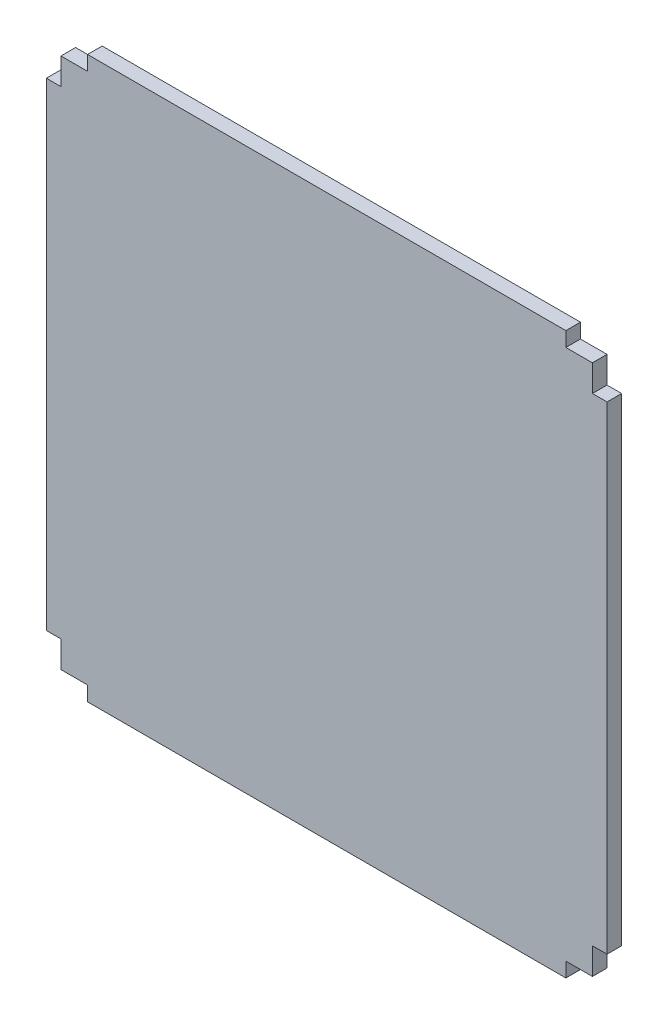
ISO-10303-21;
HEADER;
FILE_DESCRIPTION(('STEP AP214'),'2;1');
FILE_NAME('part.step','',(''),(''),'','','');
FILE_SCHEMA(('AUTOMOTIVE_DESIGN { 1 0 10303 214 1 1 1 1 }'));
ENDSEC;
DATA;
#1=APPLICATION_CONTEXT('core data for automotive mechanical design processes');
#2=APPLICATION_PROTOCOL_DEFINITION('international standard','automotive_design',2000,#1);
#3=PRODUCT_CONTEXT('',#1,'mechanical');
#4=PRODUCT('Part','Part','',(#3));
#5=PRODUCT_RELATED_PRODUCT_CATEGORY('part','',(#4));
#6=PRODUCT_DEFINITION_FORMATION('','',#4);
#7=PRODUCT_DEFINITION_CONTEXT('part definition',#1,'design');
#8=PRODUCT_DEFINITION('design','',#6,#7);
#9=PRODUCT_DEFINITION_SHAPE('','',#8);
#10=(LENGTH_UNIT() NAMED_UNIT(*) SI_UNIT(.MILLI.,.METRE.));
#11=(NAMED_UNIT(*) PLANE_ANGLE_UNIT() SI_UNIT($,.RADIAN.));
#12=(NAMED_UNIT(*) SI_UNIT($,.STERADIAN.) SOLID_ANGLE_UNIT());
#13=UNCERTAINTY_MEASURE_WITH_UNIT(LENGTH_MEASURE(1.E-05),#10,'distance_accuracy_value','');
#14=(GEOMETRIC_REPRESENTATION_CONTEXT(3) GLOBAL_UNCERTAINTY_ASSIGNED_CONTEXT((#13)) GLOBAL_UNIT_ASSIGNED_CONTEXT((#10,
#11,#12)) REPRESENTATION_CONTEXT('',''));
#15=CARTESIAN_POINT('',(0.,0.,0.));
#16=DIRECTION('',(0.,0.,1.));
#17=DIRECTION('',(1.,0.,0.));
#18=AXIS2_PLACEMENT_3D('',#15,#16,#17);
#19=CARTESIAN_POINT('',(0.,0.,2.75));
#20=DIRECTION('',(0.,1.,0.));
#21=DIRECTION('',(0.,0.,1.));
#22=AXIS2_PLACEMENT_3D('',#19,#20,#21);
#23=PLANE('',#22);
#24=DIRECTION('',(1.,0.,0.));
#25=VECTOR('',#24,1.);
#26=CARTESIAN_POINT('',(0.,0.,0.));
#27=LINE('',#26,#25);
#28=CARTESIAN_POINT('',(0.,0.,0.));
#29=VERTEX_POINT('',#28);
#30=CARTESIAN_POINT('',(5.,0.,0.));
#31=VERTEX_POINT('',#30);
#32=EDGE_CURVE('E205',#29,#31,#27,.T.);
#33=ORIENTED_EDGE('',*,*,#32,.T.);
#34=DIRECTION('',(0.,0.,-1.));
#35=VECTOR('',#34,1.);
#36=CARTESIAN_POINT('',(5.,0.,2.75));
#37=LINE('',#36,#35);
#38=CARTESIAN_POINT('',(5.,0.,2.75));
#39=VERTEX_POINT('',#38);
#40=EDGE_CURVE('E11',#39,#31,#37,.T.);
#41=ORIENTED_EDGE('',*,*,#40,.F.);
#42=DIRECTION('',(1.,0.,0.));
#43=VECTOR('',#42,1.);
#44=CARTESIAN_POINT('',(0.,0.,2.75));
#45=LINE('',#44,#43);
#46=CARTESIAN_POINT('',(0.,0.,2.75));
#47=VERTEX_POINT('',#46);
#48=EDGE_CURVE('E304',#47,#39,#45,.T.);
#49=ORIENTED_EDGE('',*,*,#48,.F.);
#50=DIRECTION('',(0.,0.,-1.));
#51=VECTOR('',#50,1.);
#52=CARTESIAN_POINT('',(0.,0.,2.75));
#53=LINE('',#52,#51);
#54=EDGE_CURVE('E200',#47,#29,#53,.T.);
#55=ORIENTED_EDGE('',*,*,#54,.T.);
#56=EDGE_LOOP('',(#33,#41,#49,#55));
#57=FACE_BOUND('',#56,.T.);
#58=ADVANCED_FACE('F35',(#57),#23,.F.);
#59=CARTESIAN_POINT('',(5.,0.,2.75));
#60=DIRECTION('',(1.,0.,0.));
#61=DIRECTION('',(0.,0.,-1.));
#62=AXIS2_PLACEMENT_3D('',#59,#60,#61);
#63=PLANE('',#62);
#64=DIRECTION('',(0.,-1.,0.));
#65=VECTOR('',#64,1.);
#66=CARTESIAN_POINT('',(5.,0.,0.));
#67=LINE('',#66,#65);
#68=CARTESIAN_POINT('',(5.,-2.75,0.));
#69=VERTEX_POINT('',#68);
#70=EDGE_CURVE('E208',#31,#69,#67,.T.);
#71=ORIENTED_EDGE('',*,*,#70,.T.);
#72=DIRECTION('',(0.,0.,-1.));
#73=VECTOR('',#72,1.);
#74=CARTESIAN_POINT('',(5.,-2.75,2.75));
#75=LINE('',#74,#73);
#76=CARTESIAN_POINT('',(5.,-2.75,2.75));
#77=VERTEX_POINT('',#76);
#78=EDGE_CURVE('E44',#77,#69,#75,.T.);
#79=ORIENTED_EDGE('',*,*,#78,.F.);
#80=DIRECTION('',(0.,-1.,0.));
#81=VECTOR('',#80,1.);
#82=CARTESIAN_POINT('',(5.,0.,2.75));
#83=LINE('',#82,#81);
#84=EDGE_CURVE('E131',#39,#77,#83,.T.);
#85=ORIENTED_EDGE('',*,*,#84,.F.);
#86=ORIENTED_EDGE('',*,*,#40,.T.);
#87=EDGE_LOOP('',(#71,#79,#85,#86));
#88=FACE_BOUND('',#87,.T.);
#89=ADVANCED_FACE('F37',(#88),#63,.F.);
#90=CARTESIAN_POINT('',(0.,-2.75,2.75));
#91=DIRECTION('',(0.,1.,0.));
#92=DIRECTION('',(0.,0.,1.));
#93=AXIS2_PLACEMENT_3D('',#90,#91,#92);
#94=PLANE('',#93);
#95=DIRECTION('',(1.,0.,0.));
#96=VECTOR('',#95,1.);
#97=CARTESIAN_POINT('',(0.,-2.75,0.));
#98=LINE('',#97,#96);
#99=CARTESIAN_POINT('',(95.,-2.75,0.));
#100=VERTEX_POINT('',#99);
#101=EDGE_CURVE('E211',#69,#100,#98,.T.);
#102=ORIENTED_EDGE('',*,*,#101,.T.);
#103=DIRECTION('',(0.,0.,-1.));
#104=VECTOR('',#103,1.);
#105=CARTESIAN_POINT('',(95.,-2.75,2.75));
#106=LINE('',#105,#104);
#107=CARTESIAN_POINT('',(95.,-2.75,2.75));
#108=VERTEX_POINT('',#107);
#109=EDGE_CURVE('E280',#108,#100,#106,.T.);
#110=ORIENTED_EDGE('',*,*,#109,.F.);
#111=DIRECTION('',(1.,0.,0.));
#112=VECTOR('',#111,1.);
#113=CARTESIAN_POINT('',(0.,-2.75,2.75));
#114=LINE('',#113,#112);
#115=EDGE_CURVE('E287',#77,#108,#114,.T.);
#116=ORIENTED_EDGE('',*,*,#115,.F.);
#117=ORIENTED_EDGE('',*,*,#78,.T.);
#118=EDGE_LOOP('',(#102,#110,#116,#117));
#119=FACE_BOUND('',#118,.T.);
#120=ADVANCED_FACE('F285',(#119),#94,.F.);
#121=CARTESIAN_POINT('',(95.,0.,2.75));
#122=DIRECTION('',(1.,0.,0.));
#123=DIRECTION('',(0.,0.,-1.));
#124=AXIS2_PLACEMENT_3D('',#121,#122,#123);
#125=PLANE('',#124);
#126=DIRECTION('',(0.,-1.,0.));
#127=VECTOR('',#126,1.);
#128=CARTESIAN_POINT('',(95.,0.,0.));
#129=LINE('',#128,#127);
#130=CARTESIAN_POINT('',(95.,0.,0.));
#131=VERTEX_POINT('',#130);
#132=EDGE_CURVE('E214',#131,#100,#129,.T.);
#133=ORIENTED_EDGE('',*,*,#132,.F.);
#134=DIRECTION('',(0.,0.,-1.));
#135=VECTOR('',#134,1.);
#136=CARTESIAN_POINT('',(95.,0.,2.75));
#137=LINE('',#136,#135);
#138=CARTESIAN_POINT('',(95.,0.,2.75));
#139=VERTEX_POINT('',#138);
#140=EDGE_CURVE('E278',#139,#131,#137,.T.);
#141=ORIENTED_EDGE('',*,*,#140,.F.);
#142=DIRECTION('',(0.,-1.,0.));
#143=VECTOR('',#142,1.);
#144=CARTESIAN_POINT('',(95.,0.,2.75));
#145=LINE('',#144,#143);
#146=EDGE_CURVE('E299',#139,#108,#145,.T.);
#147=ORIENTED_EDGE('',*,*,#146,.T.);
#148=ORIENTED_EDGE('',*,*,#109,.T.);
#149=EDGE_LOOP('',(#133,#141,#147,#148));
#150=FACE_BOUND('',#149,.T.);
#151=ADVANCED_FACE('F295',(#150),#125,.T.);
#152=CARTESIAN_POINT('',(100.,0.,0.));
#153=VERTEX_POINT('',#152);
#154=EDGE_CURVE('E209',#131,#153,#27,.T.);
#155=ORIENTED_EDGE('',*,*,#154,.T.);
#156=DIRECTION('',(0.,0.,-1.));
#157=VECTOR('',#156,1.);
#158=CARTESIAN_POINT('',(100.,0.,2.75));
#159=LINE('',#158,#157);
#160=CARTESIAN_POINT('',(100.,0.,2.75));
#161=VERTEX_POINT('',#160);
#162=EDGE_CURVE('E275',#161,#153,#159,.T.);
#163=ORIENTED_EDGE('',*,*,#162,.F.);
#164=EDGE_CURVE('E300',#139,#161,#45,.T.);
#165=ORIENTED_EDGE('',*,*,#164,.F.);
#166=ORIENTED_EDGE('',*,*,#140,.T.);
#167=EDGE_LOOP('',(#155,#163,#165,#166));
#168=FACE_BOUND('',#167,.T.);
#169=ADVANCED_FACE('F356',(#168),#23,.F.);
#170=CARTESIAN_POINT('',(100.,0.,2.75));
#171=DIRECTION('',(-1.,0.,0.));
#172=DIRECTION('',(0.,0.,1.));
#173=AXIS2_PLACEMENT_3D('',#170,#171,#172);
#174=PLANE('',#173);
#175=DIRECTION('',(0.,1.,0.));
#176=VECTOR('',#175,1.);
#177=CARTESIAN_POINT('',(100.,0.,0.));
#178=LINE('',#177,#176);
#179=CARTESIAN_POINT('',(100.,5.00000000000003,0.));
#180=VERTEX_POINT('',#179);
#181=EDGE_CURVE('E217',#153,#180,#178,.T.);
#182=ORIENTED_EDGE('',*,*,#181,.T.);
#183=DIRECTION('',(0.,0.,-1.));
#184=VECTOR('',#183,1.);
#185=CARTESIAN_POINT('',(100.,5.00000000000003,2.75));
#186=LINE('',#185,#184);
#187=CARTESIAN_POINT('',(100.,5.00000000000003,2.75));
#188=VERTEX_POINT('',#187);
#189=EDGE_CURVE('E272',#188,#180,#186,.T.);
#190=ORIENTED_EDGE('',*,*,#189,.F.);
#191=DIRECTION('',(0.,1.,0.));
#192=VECTOR('',#191,1.);
#193=CARTESIAN_POINT('',(100.,0.,2.75));
#194=LINE('',#193,#192);
#195=EDGE_CURVE('E302',#161,#188,#194,.T.);
#196=ORIENTED_EDGE('',*,*,#195,.F.);
#197=ORIENTED_EDGE('',*,*,#162,.T.);
#198=EDGE_LOOP('',(#182,#190,#196,#197));
#199=FACE_BOUND('',#198,.T.);
#200=ADVANCED_FACE('F362',(#199),#174,.F.);
#201=CARTESIAN_POINT('',(0.,5.00000000000003,2.75));
#202=DIRECTION('',(0.,1.,0.));
#203=DIRECTION('',(0.,0.,1.));
#204=AXIS2_PLACEMENT_3D('',#201,#202,#203);
#205=PLANE('',#204);
#206=DIRECTION('',(1.,0.,0.));
#207=VECTOR('',#206,1.);
#208=CARTESIAN_POINT('',(0.,5.00000000000003,0.));
#209=LINE('',#208,#207);
#210=CARTESIAN_POINT('',(102.75,5.00000000000003,0.));
#211=VERTEX_POINT('',#210);
#212=EDGE_CURVE('E219',#180,#211,#209,.T.);
#213=ORIENTED_EDGE('',*,*,#212,.T.);
#214=DIRECTION('',(0.,0.,-1.));
#215=VECTOR('',#214,1.);
#216=CARTESIAN_POINT('',(102.75,5.00000000000003,2.75));
#217=LINE('',#216,#215);
#218=CARTESIAN_POINT('',(102.75,5.00000000000003,2.75));
#219=VERTEX_POINT('',#218);
#220=EDGE_CURVE('E269',#219,#211,#217,.T.);
#221=ORIENTED_EDGE('',*,*,#220,.F.);
#222=DIRECTION('',(1.,0.,0.));
#223=VECTOR('',#222,1.);
#224=CARTESIAN_POINT('',(0.,5.00000000000003,2.75));
#225=LINE('',#224,#223);
#226=EDGE_CURVE('E309',#188,#219,#225,.T.);
#227=ORIENTED_EDGE('',*,*,#226,.F.);
#228=ORIENTED_EDGE('',*,*,#189,.T.);
#229=EDGE_LOOP('',(#213,#221,#227,#228));
#230=FACE_BOUND('',#229,.T.);
#231=ADVANCED_FACE('F368',(#230),#205,.F.);
#232=CARTESIAN_POINT('',(102.75,0.,2.75));
#233=DIRECTION('',(-1.,0.,0.));
#234=DIRECTION('',(0.,0.,1.));
#235=AXIS2_PLACEMENT_3D('',#232,#233,#234);
#236=PLANE('',#235);
#237=DIRECTION('',(0.,1.,0.));
#238=VECTOR('',#237,1.);
#239=CARTESIAN_POINT('',(102.75,0.,0.));
#240=LINE('',#239,#238);
#241=CARTESIAN_POINT('',(102.75,95.,0.));
#242=VERTEX_POINT('',#241);
#243=EDGE_CURVE('E222',#211,#242,#240,.T.);
#244=ORIENTED_EDGE('',*,*,#243,.T.);
#245=DIRECTION('',(0.,0.,-1.));
#246=VECTOR('',#245,1.);
#247=CARTESIAN_POINT('',(102.75,95.,2.75));
#248=LINE('',#247,#246);
#249=CARTESIAN_POINT('',(102.75,95.,2.75));
#250=VERTEX_POINT('',#249);
#251=EDGE_CURVE('E266',#250,#242,#248,.T.);
#252=ORIENTED_EDGE('',*,*,#251,.F.);
#253=DIRECTION('',(0.,1.,0.));
#254=VECTOR('',#253,1.);
#255=CARTESIAN_POINT('',(102.75,0.,2.75));
#256=LINE('',#255,#254);
#257=EDGE_CURVE('E312',#219,#250,#256,.T.);
#258=ORIENTED_EDGE('',*,*,#257,.F.);
#259=ORIENTED_EDGE('',*,*,#220,.T.);
#260=EDGE_LOOP('',(#244,#252,#258,#259));
#261=FACE_BOUND('',#260,.T.);
#262=ADVANCED_FACE('F383',(#261),#236,.F.);
#263=CARTESIAN_POINT('',(-9.58828975812624E-13,94.999999999999,2.75));
#264=DIRECTION('',(0.,-1.,0.));
#265=DIRECTION('',(1.,0.,0.));
#266=AXIS2_PLACEMENT_3D('',#263,#264,#265);
#267=PLANE('',#266);
#268=DIRECTION('',(-1.,0.,0.));
#269=VECTOR('',#268,1.);
#270=CARTESIAN_POINT('',(-9.58828975812624E-13,94.999999999999,0.));
#271=LINE('',#270,#269);
#272=CARTESIAN_POINT('',(100.,95.,0.));
#273=VERTEX_POINT('',#272);
#274=EDGE_CURVE('E224',#242,#273,#271,.T.);
#275=ORIENTED_EDGE('',*,*,#274,.T.);
#276=DIRECTION('',(0.,0.,-1.));
#277=VECTOR('',#276,1.);
#278=CARTESIAN_POINT('',(100.,95.,2.75));
#279=LINE('',#278,#277);
#280=CARTESIAN_POINT('',(100.,95.,2.75));
#281=VERTEX_POINT('',#280);
#282=EDGE_CURVE('E263',#281,#273,#279,.T.);
#283=ORIENTED_EDGE('',*,*,#282,.F.);
#284=DIRECTION('',(-1.,0.,0.));
#285=VECTOR('',#284,1.);
#286=CARTESIAN_POINT('',(-9.58828975812624E-13,94.999999999999,2.75));
#287=LINE('',#286,#285);
#288=EDGE_CURVE('E314',#250,#281,#287,.T.);
#289=ORIENTED_EDGE('',*,*,#288,.F.);
#290=ORIENTED_EDGE('',*,*,#251,.T.);
#291=EDGE_LOOP('',(#275,#283,#289,#290));
#292=FACE_BOUND('',#291,.T.);
#293=ADVANCED_FACE('F391',(#292),#267,.F.);
#294=CARTESIAN_POINT('',(100.,100.,0.));
#295=VERTEX_POINT('',#294);
#296=EDGE_CURVE('E220',#273,#295,#178,.T.);
#297=ORIENTED_EDGE('',*,*,#296,.T.);
#298=DIRECTION('',(0.,0.,-1.));
#299=VECTOR('',#298,1.);
#300=CARTESIAN_POINT('',(100.,100.,2.75));
#301=LINE('',#300,#299);
#302=CARTESIAN_POINT('',(100.,100.,2.75));
#303=VERTEX_POINT('',#302);
#304=EDGE_CURVE('E261',#303,#295,#301,.T.);
#305=ORIENTED_EDGE('',*,*,#304,.F.);
#306=EDGE_CURVE('E310',#281,#303,#194,.T.);
#307=ORIENTED_EDGE('',*,*,#306,.F.);
#308=ORIENTED_EDGE('',*,*,#282,.T.);
#309=EDGE_LOOP('',(#297,#305,#307,#308));
#310=FACE_BOUND('',#309,.T.);
#311=ADVANCED_FACE('F371',(#310),#174,.F.);
#312=CARTESIAN_POINT('',(0.,100.,2.75));
#313=DIRECTION('',(0.,1.,0.));
#314=DIRECTION('',(0.,0.,1.));
#315=AXIS2_PLACEMENT_3D('',#312,#313,#314);
#316=PLANE('',#315);
#317=DIRECTION('',(1.,0.,0.));
#318=VECTOR('',#317,1.);
#319=CARTESIAN_POINT('',(0.,100.,0.));
#320=LINE('',#319,#318);
#321=CARTESIAN_POINT('',(95.,100.,0.));
#322=VERTEX_POINT('',#321);
#323=EDGE_CURVE('E226',#322,#295,#320,.T.);
#324=ORIENTED_EDGE('',*,*,#323,.F.);
#325=DIRECTION('',(0.,0.,-1.));
#326=VECTOR('',#325,1.);
#327=CARTESIAN_POINT('',(95.,100.,2.75));
#328=LINE('',#327,#326);
#329=CARTESIAN_POINT('',(95.,100.,2.75));
#330=VERTEX_POINT('',#329);
#331=EDGE_CURVE('E259',#330,#322,#328,.T.);
#332=ORIENTED_EDGE('',*,*,#331,.F.);
#333=DIRECTION('',(1.,0.,0.));
#334=VECTOR('',#333,1.);
#335=CARTESIAN_POINT('',(0.,100.,2.75));
#336=LINE('',#335,#334);
#337=EDGE_CURVE('E316',#330,#303,#336,.T.);
#338=ORIENTED_EDGE('',*,*,#337,.T.);
#339=ORIENTED_EDGE('',*,*,#304,.T.);
#340=EDGE_LOOP('',(#324,#332,#338,#339));
#341=FACE_BOUND('',#340,.T.);
#342=ADVANCED_FACE('F397',(#341),#316,.T.);
#343=CARTESIAN_POINT('',(95.,0.,2.75));
#344=DIRECTION('',(-1.,0.,0.));
#345=DIRECTION('',(0.,0.,1.));
#346=AXIS2_PLACEMENT_3D('',#343,#344,#345);
#347=PLANE('',#346);
#348=DIRECTION('',(0.,1.,0.));
#349=VECTOR('',#348,1.);
#350=CARTESIAN_POINT('',(95.,0.,0.));
#351=LINE('',#350,#349);
#352=CARTESIAN_POINT('',(95.,102.75,0.));
#353=VERTEX_POINT('',#352);
#354=EDGE_CURVE('E229',#322,#353,#351,.T.);
#355=ORIENTED_EDGE('',*,*,#354,.T.);
#356=DIRECTION('',(0.,0.,-1.));
#357=VECTOR('',#356,1.);
#358=CARTESIAN_POINT('',(95.,102.75,2.75));
#359=LINE('',#358,#357);
#360=CARTESIAN_POINT('',(95.,102.75,2.75));
#361=VERTEX_POINT('',#360);
#362=EDGE_CURVE('E256',#361,#353,#359,.T.);
#363=ORIENTED_EDGE('',*,*,#362,.F.);
#364=DIRECTION('',(0.,1.,0.));
#365=VECTOR('',#364,1.);
#366=CARTESIAN_POINT('',(95.,0.,2.75));
#367=LINE('',#366,#365);
#368=EDGE_CURVE('E319',#330,#361,#367,.T.);
#369=ORIENTED_EDGE('',*,*,#368,.F.);
#370=ORIENTED_EDGE('',*,*,#331,.T.);
#371=EDGE_LOOP('',(#355,#363,#369,#370));
#372=FACE_BOUND('',#371,.T.);
#373=ADVANCED_FACE('F401',(#372),#347,.F.);
#374=CARTESIAN_POINT('',(0.,102.75,2.75));
#375=DIRECTION('',(0.,-1.,0.));
#376=DIRECTION('',(0.,0.,-1.));
#377=AXIS2_PLACEMENT_3D('',#374,#375,#376);
#378=PLANE('',#377);
#379=DIRECTION('',(-1.,0.,0.));
#380=VECTOR('',#379,1.);
#381=CARTESIAN_POINT('',(0.,102.75,0.));
#382=LINE('',#381,#380);
#383=CARTESIAN_POINT('',(5.,102.75,0.));
#384=VERTEX_POINT('',#383);
#385=EDGE_CURVE('E232',#353,#384,#382,.T.);
#386=ORIENTED_EDGE('',*,*,#385,.T.);
#387=DIRECTION('',(0.,0.,-1.));
#388=VECTOR('',#387,1.);
#389=CARTESIAN_POINT('',(5.,102.75,2.75));
#390=LINE('',#389,#388);
#391=CARTESIAN_POINT('',(5.,102.75,2.75));
#392=VERTEX_POINT('',#391);
#393=EDGE_CURVE('E253',#392,#384,#390,.T.);
#394=ORIENTED_EDGE('',*,*,#393,.F.);
#395=DIRECTION('',(-1.,0.,0.));
#396=VECTOR('',#395,1.);
#397=CARTESIAN_POINT('',(0.,102.75,2.75));
#398=LINE('',#397,#396);
#399=EDGE_CURVE('E322',#361,#392,#398,.T.);
#400=ORIENTED_EDGE('',*,*,#399,.F.);
#401=ORIENTED_EDGE('',*,*,#362,.T.);
#402=EDGE_LOOP('',(#386,#394,#400,#401));
#403=FACE_BOUND('',#402,.T.);
#404=ADVANCED_FACE('F404',(#403),#378,.F.);
#405=CARTESIAN_POINT('',(5.,0.,2.75));
#406=DIRECTION('',(1.,0.,0.));
#407=DIRECTION('',(0.,0.,-1.));
#408=AXIS2_PLACEMENT_3D('',#405,#406,#407);
#409=PLANE('',#408);
#410=DIRECTION('',(0.,-1.,0.));
#411=VECTOR('',#410,1.);
#412=CARTESIAN_POINT('',(5.,0.,0.));
#413=LINE('',#412,#411);
#414=CARTESIAN_POINT('',(5.,100.,0.));
#415=VERTEX_POINT('',#414);
#416=EDGE_CURVE('E234',#384,#415,#413,.T.);
#417=ORIENTED_EDGE('',*,*,#416,.T.);
#418=DIRECTION('',(0.,0.,-1.));
#419=VECTOR('',#418,1.);
#420=CARTESIAN_POINT('',(5.,100.,2.75));
#421=LINE('',#420,#419);
#422=CARTESIAN_POINT('',(5.,100.,2.75));
#423=VERTEX_POINT('',#422);
#424=EDGE_CURVE('E251',#423,#415,#421,.T.);
#425=ORIENTED_EDGE('',*,*,#424,.F.);
#426=DIRECTION('',(0.,-1.,0.));
#427=VECTOR('',#426,1.);
#428=CARTESIAN_POINT('',(5.,0.,2.75));
#429=LINE('',#428,#427);
#430=EDGE_CURVE('E324',#392,#423,#429,.T.);
#431=ORIENTED_EDGE('',*,*,#430,.F.);
#432=ORIENTED_EDGE('',*,*,#393,.T.);
#433=EDGE_LOOP('',(#417,#425,#431,#432));
#434=FACE_BOUND('',#433,.T.);
#435=ADVANCED_FACE('F337',(#434),#409,.F.);
#436=CARTESIAN_POINT('',(0.,100.,0.));
#437=VERTEX_POINT('',#436);
#438=EDGE_CURVE('E230',#437,#415,#320,.T.);
#439=ORIENTED_EDGE('',*,*,#438,.F.);
#440=DIRECTION('',(0.,0.,-1.));
#441=VECTOR('',#440,1.);
#442=CARTESIAN_POINT('',(0.,100.,2.75));
#443=LINE('',#442,#441);
#444=CARTESIAN_POINT('',(0.,100.,2.75));
#445=VERTEX_POINT('',#444);
#446=EDGE_CURVE('E249',#445,#437,#443,.T.);
#447=ORIENTED_EDGE('',*,*,#446,.F.);
#448=EDGE_CURVE('E320',#445,#423,#336,.T.);
#449=ORIENTED_EDGE('',*,*,#448,.T.);
#450=ORIENTED_EDGE('',*,*,#424,.T.);
#451=EDGE_LOOP('',(#439,#447,#449,#450));
#452=FACE_BOUND('',#451,.T.);
#453=ADVANCED_FACE('F331',(#452),#316,.T.);
#454=CARTESIAN_POINT('',(0.,0.,2.75));
#455=DIRECTION('',(1.,0.,0.));
#456=DIRECTION('',(0.,0.,-1.));
#457=AXIS2_PLACEMENT_3D('',#454,#455,#456);
#458=PLANE('',#457);
#459=DIRECTION('',(0.,-1.,0.));
#460=VECTOR('',#459,1.);
#461=CARTESIAN_POINT('',(0.,0.,0.));
#462=LINE('',#461,#460);
#463=CARTESIAN_POINT('',(0.,95.,0.));
#464=VERTEX_POINT('',#463);
#465=EDGE_CURVE('E237',#437,#464,#462,.T.);
#466=ORIENTED_EDGE('',*,*,#465,.T.);
#467=DIRECTION('',(0.,0.,-1.));
#468=VECTOR('',#467,1.);
#469=CARTESIAN_POINT('',(0.,95.,2.75));
#470=LINE('',#469,#468);
#471=CARTESIAN_POINT('',(0.,95.,2.75));
#472=VERTEX_POINT('',#471);
#473=EDGE_CURVE('E246',#472,#464,#470,.T.);
#474=ORIENTED_EDGE('',*,*,#473,.F.);
#475=DIRECTION('',(0.,-1.,0.));
#476=VECTOR('',#475,1.);
#477=CARTESIAN_POINT('',(0.,0.,2.75));
#478=LINE('',#477,#476);
#479=EDGE_CURVE('E202',#445,#472,#478,.T.);
#480=ORIENTED_EDGE('',*,*,#479,.F.);
#481=ORIENTED_EDGE('',*,*,#446,.T.);
#482=EDGE_LOOP('',(#466,#474,#480,#481));
#483=FACE_BOUND('',#482,.T.);
#484=ADVANCED_FACE('F344',(#483),#458,.F.);
#485=CARTESIAN_POINT('',(0.,95.,2.75));
#486=DIRECTION('',(0.,-1.,0.));
#487=DIRECTION('',(0.,0.,-1.));
#488=AXIS2_PLACEMENT_3D('',#485,#486,#487);
#489=PLANE('',#488);
#490=DIRECTION('',(-1.,0.,0.));
#491=VECTOR('',#490,1.);
#492=CARTESIAN_POINT('',(0.,95.,0.));
#493=LINE('',#492,#491);
#494=CARTESIAN_POINT('',(-2.75,95.,0.));
#495=VERTEX_POINT('',#494);
#496=EDGE_CURVE('E239',#464,#495,#493,.T.);
#497=ORIENTED_EDGE('',*,*,#496,.T.);
#498=DIRECTION('',(0.,0.,-1.));
#499=VECTOR('',#498,1.);
#500=CARTESIAN_POINT('',(-2.75,95.,2.75));
#501=LINE('',#500,#499);
#502=CARTESIAN_POINT('',(-2.75,95.,2.75));
#503=VERTEX_POINT('',#502);
#504=EDGE_CURVE('E195',#503,#495,#501,.T.);
#505=ORIENTED_EDGE('',*,*,#504,.F.);
#506=DIRECTION('',(-1.,0.,0.));
#507=VECTOR('',#506,1.);
#508=CARTESIAN_POINT('',(0.,95.,2.75));
#509=LINE('',#508,#507);
#510=EDGE_CURVE('E186',#472,#503,#509,.T.);
#511=ORIENTED_EDGE('',*,*,#510,.F.);
#512=ORIENTED_EDGE('',*,*,#473,.T.);
#513=EDGE_LOOP('',(#497,#505,#511,#512));
#514=FACE_BOUND('',#513,.T.);
#515=ADVANCED_FACE('F346',(#514),#489,.F.);
#516=CARTESIAN_POINT('',(-2.75,0.,2.75));
#517=DIRECTION('',(1.,0.,0.));
#518=DIRECTION('',(0.,0.,-1.));
#519=AXIS2_PLACEMENT_3D('',#516,#517,#518);
#520=PLANE('',#519);
#521=DIRECTION('',(0.,-1.,0.));
#522=VECTOR('',#521,1.);
#523=CARTESIAN_POINT('',(-2.75,0.,0.));
#524=LINE('',#523,#522);
#525=CARTESIAN_POINT('',(-2.75,5.,0.));
#526=VERTEX_POINT('',#525);
#527=EDGE_CURVE('E194',#495,#526,#524,.T.);
#528=ORIENTED_EDGE('',*,*,#527,.T.);
#529=DIRECTION('',(0.,0.,-1.));
#530=VECTOR('',#529,1.);
#531=CARTESIAN_POINT('',(-2.75,5.,2.75));
#532=LINE('',#531,#530);
#533=CARTESIAN_POINT('',(-2.75,5.,2.75));
#534=VERTEX_POINT('',#533);
#535=EDGE_CURVE('E191',#534,#526,#532,.T.);
#536=ORIENTED_EDGE('',*,*,#535,.F.);
#537=DIRECTION('',(0.,-1.,0.));
#538=VECTOR('',#537,1.);
#539=CARTESIAN_POINT('',(-2.75,0.,2.75));
#540=LINE('',#539,#538);
#541=EDGE_CURVE('E180',#503,#534,#540,.T.);
#542=ORIENTED_EDGE('',*,*,#541,.F.);
#543=ORIENTED_EDGE('',*,*,#504,.T.);
#544=EDGE_LOOP('',(#528,#536,#542,#543));
#545=FACE_BOUND('',#544,.T.);
#546=ADVANCED_FACE('F192',(#545),#520,.F.);
#547=CARTESIAN_POINT('',(0.,5.00000000000003,2.75));
#548=DIRECTION('',(0.,1.,0.));
#549=DIRECTION('',(-1.,0.,0.));
#550=AXIS2_PLACEMENT_3D('',#547,#548,#549);
#551=PLANE('',#550);
#552=DIRECTION('',(1.,0.,0.));
#553=VECTOR('',#552,1.);
#554=CARTESIAN_POINT('',(0.,5.00000000000003,0.));
#555=LINE('',#554,#553);
#556=CARTESIAN_POINT('',(0.,5.00000000000002,0.));
#557=VERTEX_POINT('',#556);
#558=EDGE_CURVE('E117',#526,#557,#555,.T.);
#559=ORIENTED_EDGE('',*,*,#558,.T.);
#560=DIRECTION('',(0.,0.,-1.));
#561=VECTOR('',#560,1.);
#562=CARTESIAN_POINT('',(0.,5.00000000000002,2.75));
#563=LINE('',#562,#561);
#564=CARTESIAN_POINT('',(0.,5.00000000000002,2.75));
#565=VERTEX_POINT('',#564);
#566=EDGE_CURVE('E196',#565,#557,#563,.T.);
#567=ORIENTED_EDGE('',*,*,#566,.F.);
#568=DIRECTION('',(1.,0.,0.));
#569=VECTOR('',#568,1.);
#570=CARTESIAN_POINT('',(0.,5.00000000000003,2.75));
#571=LINE('',#570,#569);
#572=EDGE_CURVE('E184',#534,#565,#571,.T.);
#573=ORIENTED_EDGE('',*,*,#572,.F.);
#574=ORIENTED_EDGE('',*,*,#535,.T.);
#575=EDGE_LOOP('',(#559,#567,#573,#574));
#576=FACE_BOUND('',#575,.T.);
#577=ADVANCED_FACE('F198',(#576),#551,.F.);
#578=EDGE_CURVE('E123',#557,#29,#462,.T.);
#579=ORIENTED_EDGE('',*,*,#578,.T.);
#580=ORIENTED_EDGE('',*,*,#54,.F.);
#581=EDGE_CURVE('E52',#565,#47,#478,.T.);
#582=ORIENTED_EDGE('',*,*,#581,.F.);
#583=ORIENTED_EDGE('',*,*,#566,.T.);
#584=EDGE_LOOP('',(#579,#580,#582,#583));
#585=FACE_BOUND('',#584,.T.);
#586=ADVANCED_FACE('F474',(#585),#458,.F.);
#587=CARTESIAN_POINT('',(0.,0.,2.75));
#588=DIRECTION('',(0.,0.,1.));
#589=DIRECTION('',(1.,0.,0.));
#590=AXIS2_PLACEMENT_3D('',#587,#588,#589);
#591=PLANE('',#590);
#592=ORIENTED_EDGE('',*,*,#48,.T.);
#593=ORIENTED_EDGE('',*,*,#84,.T.);
#594=ORIENTED_EDGE('',*,*,#115,.T.);
#595=ORIENTED_EDGE('',*,*,#146,.F.);
#596=ORIENTED_EDGE('',*,*,#164,.T.);
#597=ORIENTED_EDGE('',*,*,#195,.T.);
#598=ORIENTED_EDGE('',*,*,#226,.T.);
#599=ORIENTED_EDGE('',*,*,#257,.T.);
#600=ORIENTED_EDGE('',*,*,#288,.T.);
#601=ORIENTED_EDGE('',*,*,#306,.T.);
#602=ORIENTED_EDGE('',*,*,#337,.F.);
#603=ORIENTED_EDGE('',*,*,#368,.T.);
#604=ORIENTED_EDGE('',*,*,#399,.T.);
#605=ORIENTED_EDGE('',*,*,#430,.T.);
#606=ORIENTED_EDGE('',*,*,#448,.F.);
#607=ORIENTED_EDGE('',*,*,#479,.T.);
#608=ORIENTED_EDGE('',*,*,#510,.T.);
#609=ORIENTED_EDGE('',*,*,#541,.T.);
#610=ORIENTED_EDGE('',*,*,#572,.T.);
#611=ORIENTED_EDGE('',*,*,#581,.T.);
#612=EDGE_LOOP('',(#592,#593,#594,#595,#596,#597,#598,#599,#600,#601,#602,#603,#604,#605,#606,
#607,#608,#609,#610,#611));
#613=FACE_BOUND('',#612,.T.);
#614=ADVANCED_FACE('F182',(#613),#591,.T.);
#615=CARTESIAN_POINT('',(0.,0.,0.));
#616=DIRECTION('',(0.,0.,1.));
#617=DIRECTION('',(1.,0.,0.));
#618=AXIS2_PLACEMENT_3D('',#615,#616,#617);
#619=PLANE('',#618);
#620=ORIENTED_EDGE('',*,*,#32,.F.);
#621=ORIENTED_EDGE('',*,*,#578,.F.);
#622=ORIENTED_EDGE('',*,*,#558,.F.);
#623=ORIENTED_EDGE('',*,*,#527,.F.);
#624=ORIENTED_EDGE('',*,*,#496,.F.);
#625=ORIENTED_EDGE('',*,*,#465,.F.);
#626=ORIENTED_EDGE('',*,*,#438,.T.);
#627=ORIENTED_EDGE('',*,*,#416,.F.);
#628=ORIENTED_EDGE('',*,*,#385,.F.);
#629=ORIENTED_EDGE('',*,*,#354,.F.);
#630=ORIENTED_EDGE('',*,*,#323,.T.);
#631=ORIENTED_EDGE('',*,*,#296,.F.);
#632=ORIENTED_EDGE('',*,*,#274,.F.);
#633=ORIENTED_EDGE('',*,*,#243,.F.);
#634=ORIENTED_EDGE('',*,*,#212,.F.);
#635=ORIENTED_EDGE('',*,*,#181,.F.);
#636=ORIENTED_EDGE('',*,*,#154,.F.);
#637=ORIENTED_EDGE('',*,*,#132,.T.);
#638=ORIENTED_EDGE('',*,*,#101,.F.);
#639=ORIENTED_EDGE('',*,*,#70,.F.);
#640=EDGE_LOOP('',(#620,#621,#622,#623,#624,#625,#626,#627,#628,#629,#630,#631,#632,#633,#634,
#635,#636,#637,#638,#639));
#641=FACE_BOUND('',#640,.T.);
#642=ADVANCED_FACE('F290',(#641),#619,.F.);
#643=CLOSED_SHELL('',(#58,#89,#120,#151,#169,#200,#231,#262,#293,#311,#342,#373,#404,#435,#453,
#484,#515,#546,#577,#586,#614,#642));
#644=MANIFOLD_SOLID_BREP('B2',#643);
#645=ADVANCED_BREP_SHAPE_REPRESENTATION('',(#18,#644),#14);
#646=SHAPE_DEFINITION_REPRESENTATION(#9,#645);
ENDSEC;
END-ISO-10303-21;
